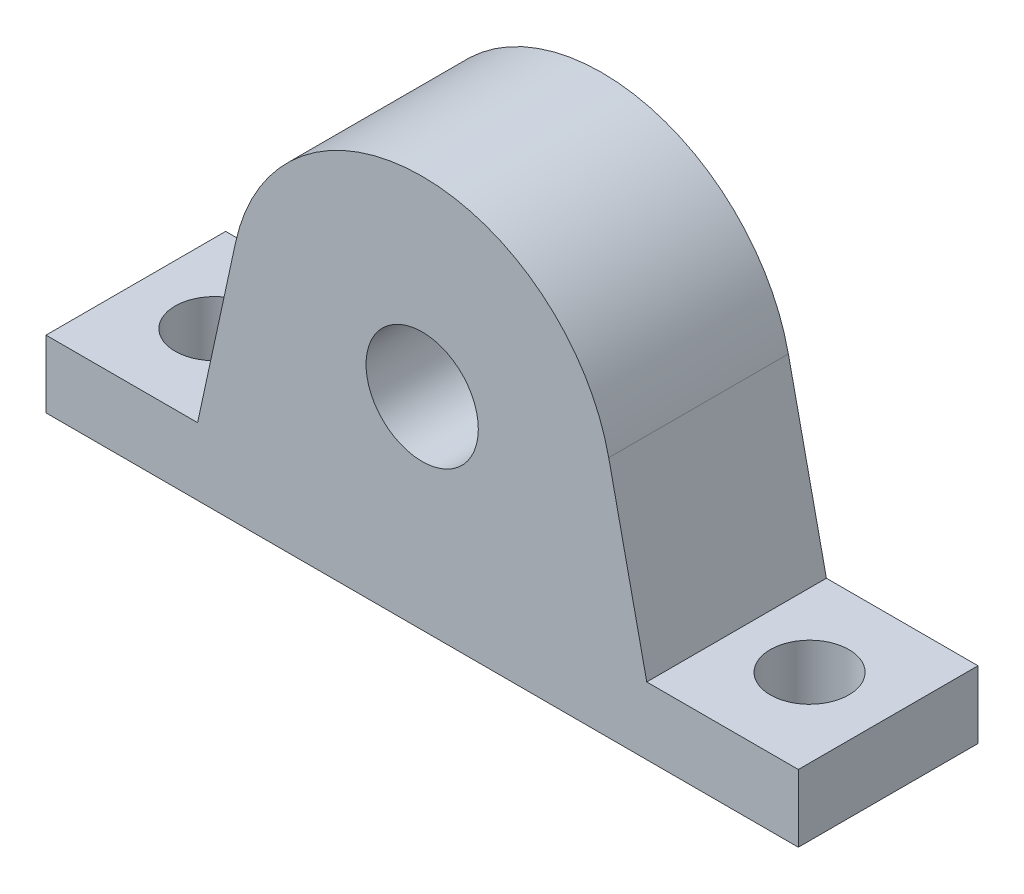
ISO-10303-21;
HEADER;
FILE_DESCRIPTION(('STEP AP214'),'2;1');
FILE_NAME('part.step','',(''),(''),'','','');
FILE_SCHEMA(('AUTOMOTIVE_DESIGN { 1 0 10303 214 1 1 1 1 }'));
ENDSEC;
DATA;
#1=APPLICATION_CONTEXT('core data for automotive mechanical design processes');
#2=APPLICATION_PROTOCOL_DEFINITION('international standard','automotive_design',2000,#1);
#3=PRODUCT_CONTEXT('',#1,'mechanical');
#4=PRODUCT('Part','Part','',(#3));
#5=PRODUCT_RELATED_PRODUCT_CATEGORY('part','',(#4));
#6=PRODUCT_DEFINITION_FORMATION('','',#4);
#7=PRODUCT_DEFINITION_CONTEXT('part definition',#1,'design');
#8=PRODUCT_DEFINITION('design','',#6,#7);
#9=PRODUCT_DEFINITION_SHAPE('','',#8);
#10=(LENGTH_UNIT() NAMED_UNIT(*) SI_UNIT(.MILLI.,.METRE.));
#11=(NAMED_UNIT(*) PLANE_ANGLE_UNIT() SI_UNIT($,.RADIAN.));
#12=(NAMED_UNIT(*) SI_UNIT($,.STERADIAN.) SOLID_ANGLE_UNIT());
#13=UNCERTAINTY_MEASURE_WITH_UNIT(LENGTH_MEASURE(1.E-05),#10,'distance_accuracy_value','');
#14=(GEOMETRIC_REPRESENTATION_CONTEXT(3) GLOBAL_UNCERTAINTY_ASSIGNED_CONTEXT((#13)) GLOBAL_UNIT_ASSIGNED_CONTEXT((#10,
#11,#12)) REPRESENTATION_CONTEXT('',''));
#15=CARTESIAN_POINT('',(0.,0.,0.));
#16=DIRECTION('',(0.,0.,1.));
#17=DIRECTION('',(1.,0.,0.));
#18=AXIS2_PLACEMENT_3D('',#15,#16,#17);
#19=CARTESIAN_POINT('',(-33.5,0.,8.));
#20=DIRECTION('',(1.,0.,0.));
#21=DIRECTION('',(0.,0.,-1.));
#22=AXIS2_PLACEMENT_3D('',#19,#20,#21);
#23=PLANE('',#22);
#24=DIRECTION('',(0.,-1.,0.));
#25=VECTOR('',#24,1.);
#26=CARTESIAN_POINT('',(-33.5,0.,-8.));
#27=LINE('',#26,#25);
#28=CARTESIAN_POINT('',(-33.5,6.,-8.));
#29=VERTEX_POINT('',#28);
#30=CARTESIAN_POINT('',(-33.5,0.,-8.));
#31=VERTEX_POINT('',#30);
#32=EDGE_CURVE('E140',#29,#31,#27,.T.);
#33=ORIENTED_EDGE('',*,*,#32,.T.);
#34=DIRECTION('',(0.,0.,-1.));
#35=VECTOR('',#34,1.);
#36=CARTESIAN_POINT('',(-33.5,0.,8.));
#37=LINE('',#36,#35);
#38=CARTESIAN_POINT('',(-33.5,0.,8.));
#39=VERTEX_POINT('',#38);
#40=EDGE_CURVE('E11',#39,#31,#37,.T.);
#41=ORIENTED_EDGE('',*,*,#40,.F.);
#42=DIRECTION('',(0.,-1.,0.));
#43=VECTOR('',#42,1.);
#44=CARTESIAN_POINT('',(-33.5,0.,8.));
#45=LINE('',#44,#43);
#46=CARTESIAN_POINT('',(-33.5,6.,8.));
#47=VERTEX_POINT('',#46);
#48=EDGE_CURVE('E163',#47,#39,#45,.T.);
#49=ORIENTED_EDGE('',*,*,#48,.F.);
#50=DIRECTION('',(0.,0.,-1.));
#51=VECTOR('',#50,1.);
#52=CARTESIAN_POINT('',(-33.5,6.,8.));
#53=LINE('',#52,#51);
#54=EDGE_CURVE('E136',#47,#29,#53,.T.);
#55=ORIENTED_EDGE('',*,*,#54,.T.);
#56=EDGE_LOOP('',(#33,#41,#49,#55));
#57=FACE_BOUND('',#56,.T.);
#58=ADVANCED_FACE('F39',(#57),#23,.F.);
#59=CARTESIAN_POINT('',(-33.5,0.,8.));
#60=DIRECTION('',(0.,1.,0.));
#61=DIRECTION('',(0.,0.,1.));
#62=AXIS2_PLACEMENT_3D('',#59,#60,#61);
#63=PLANE('',#62);
#64=CARTESIAN_POINT('',(-26.5,0.,0.));
#65=DIRECTION('',(0.,1.,0.));
#66=DIRECTION('',(0.,0.,1.));
#67=AXIS2_PLACEMENT_3D('',#64,#65,#66);
#68=CIRCLE('',#67,3.5);
#69=CARTESIAN_POINT('',(-26.5,0.,3.5));
#70=VERTEX_POINT('',#69);
#71=EDGE_CURVE('E210',#70,#70,#68,.T.);
#72=ORIENTED_EDGE('',*,*,#71,.T.);
#73=EDGE_LOOP('',(#72));
#74=FACE_BOUND('',#73,.T.);
#75=CARTESIAN_POINT('',(26.5,0.,0.));
#76=DIRECTION('',(0.,1.,0.));
#77=DIRECTION('',(0.,0.,1.));
#78=AXIS2_PLACEMENT_3D('',#75,#76,#77);
#79=CIRCLE('',#78,3.5);
#80=CARTESIAN_POINT('',(26.5,0.,3.5));
#81=VERTEX_POINT('',#80);
#82=EDGE_CURVE('E145',#81,#81,#79,.T.);
#83=ORIENTED_EDGE('',*,*,#82,.T.);
#84=EDGE_LOOP('',(#83));
#85=FACE_BOUND('',#84,.T.);
#86=DIRECTION('',(1.,0.,0.));
#87=VECTOR('',#86,1.);
#88=CARTESIAN_POINT('',(-33.5,0.,-8.));
#89=LINE('',#88,#87);
#90=CARTESIAN_POINT('',(33.5,0.,-8.));
#91=VERTEX_POINT('',#90);
#92=EDGE_CURVE('E144',#31,#91,#89,.T.);
#93=ORIENTED_EDGE('',*,*,#92,.T.);
#94=DIRECTION('',(0.,0.,-1.));
#95=VECTOR('',#94,1.);
#96=CARTESIAN_POINT('',(33.5,0.,8.));
#97=LINE('',#96,#95);
#98=CARTESIAN_POINT('',(33.5,0.,8.));
#99=VERTEX_POINT('',#98);
#100=EDGE_CURVE('E48',#99,#91,#97,.T.);
#101=ORIENTED_EDGE('',*,*,#100,.F.);
#102=DIRECTION('',(1.,0.,0.));
#103=VECTOR('',#102,1.);
#104=CARTESIAN_POINT('',(-33.5,0.,8.));
#105=LINE('',#104,#103);
#106=EDGE_CURVE('E99',#39,#99,#105,.T.);
#107=ORIENTED_EDGE('',*,*,#106,.F.);
#108=ORIENTED_EDGE('',*,*,#40,.T.);
#109=EDGE_LOOP('',(#93,#101,#107,#108));
#110=FACE_BOUND('',#109,.T.);
#111=ADVANCED_FACE('F252',(#74,#85,#110),#63,.F.);
#112=CARTESIAN_POINT('',(33.5,0.,8.));
#113=DIRECTION('',(-1.,0.,0.));
#114=DIRECTION('',(0.,0.,1.));
#115=AXIS2_PLACEMENT_3D('',#112,#113,#114);
#116=PLANE('',#115);
#117=DIRECTION('',(0.,1.,0.));
#118=VECTOR('',#117,1.);
#119=CARTESIAN_POINT('',(33.5,0.,-8.));
#120=LINE('',#119,#118);
#121=CARTESIAN_POINT('',(33.5,6.,-8.));
#122=VERTEX_POINT('',#121);
#123=EDGE_CURVE('E148',#91,#122,#120,.T.);
#124=ORIENTED_EDGE('',*,*,#123,.T.);
#125=DIRECTION('',(0.,0.,-1.));
#126=VECTOR('',#125,1.);
#127=CARTESIAN_POINT('',(33.5,6.,8.));
#128=LINE('',#127,#126);
#129=CARTESIAN_POINT('',(33.5,6.,8.));
#130=VERTEX_POINT('',#129);
#131=EDGE_CURVE('E174',#130,#122,#128,.T.);
#132=ORIENTED_EDGE('',*,*,#131,.F.);
#133=DIRECTION('',(0.,1.,0.));
#134=VECTOR('',#133,1.);
#135=CARTESIAN_POINT('',(33.5,0.,8.));
#136=LINE('',#135,#134);
#137=EDGE_CURVE('E184',#99,#130,#136,.T.);
#138=ORIENTED_EDGE('',*,*,#137,.F.);
#139=ORIENTED_EDGE('',*,*,#100,.T.);
#140=EDGE_LOOP('',(#124,#132,#138,#139));
#141=FACE_BOUND('',#140,.T.);
#142=ADVANCED_FACE('F182',(#141),#116,.F.);
#143=CARTESIAN_POINT('',(33.5,6.,8.));
#144=DIRECTION('',(0.,-1.,0.));
#145=DIRECTION('',(0.,0.,-1.));
#146=AXIS2_PLACEMENT_3D('',#143,#144,#145);
#147=PLANE('',#146);
#148=CARTESIAN_POINT('',(26.5,6.,0.));
#149=DIRECTION('',(0.,1.,0.));
#150=DIRECTION('',(0.,0.,1.));
#151=AXIS2_PLACEMENT_3D('',#148,#149,#150);
#152=CIRCLE('',#151,3.5);
#153=CARTESIAN_POINT('',(26.5,6.,3.5));
#154=VERTEX_POINT('',#153);
#155=EDGE_CURVE('E215',#154,#154,#152,.T.);
#156=ORIENTED_EDGE('',*,*,#155,.F.);
#157=EDGE_LOOP('',(#156));
#158=FACE_BOUND('',#157,.T.);
#159=DIRECTION('',(-1.,0.,0.));
#160=VECTOR('',#159,1.);
#161=CARTESIAN_POINT('',(33.5,6.,-8.));
#162=LINE('',#161,#160);
#163=CARTESIAN_POINT('',(20.,6.,-8.));
#164=VERTEX_POINT('',#163);
#165=EDGE_CURVE('E151',#122,#164,#162,.T.);
#166=ORIENTED_EDGE('',*,*,#165,.T.);
#167=DIRECTION('',(0.,0.,-1.));
#168=VECTOR('',#167,1.);
#169=CARTESIAN_POINT('',(20.,6.,8.));
#170=LINE('',#169,#168);
#171=CARTESIAN_POINT('',(20.,6.,8.));
#172=VERTEX_POINT('',#171);
#173=EDGE_CURVE('E170',#172,#164,#170,.T.);
#174=ORIENTED_EDGE('',*,*,#173,.F.);
#175=DIRECTION('',(-1.,0.,0.));
#176=VECTOR('',#175,1.);
#177=CARTESIAN_POINT('',(33.5,6.,8.));
#178=LINE('',#177,#176);
#179=EDGE_CURVE('E197',#130,#172,#178,.T.);
#180=ORIENTED_EDGE('',*,*,#179,.F.);
#181=ORIENTED_EDGE('',*,*,#131,.T.);
#182=EDGE_LOOP('',(#166,#174,#180,#181));
#183=FACE_BOUND('',#182,.T.);
#184=ADVANCED_FACE('F192',(#158,#183),#147,.F.);
#185=CARTESIAN_POINT('',(20.,6.,8.));
#186=DIRECTION('',(-0.977251163735397,-0.212085272892327,0.));
#187=DIRECTION('',(0.212085272892327,-0.977251163735397,0.));
#188=AXIS2_PLACEMENT_3D('',#185,#186,#187);
#189=PLANE('',#188);
#190=DIRECTION('',(-0.212085272892327,0.977251163735397,0.));
#191=VECTOR('',#190,1.);
#192=CARTESIAN_POINT('',(20.,6.,-8.));
#193=LINE('',#192,#191);
#194=CARTESIAN_POINT('',(16.6132697835017,21.6054496391696,-8.));
#195=VERTEX_POINT('',#194);
#196=EDGE_CURVE('E154',#164,#195,#193,.T.);
#197=ORIENTED_EDGE('',*,*,#196,.T.);
#198=DIRECTION('',(0.,0.,-1.));
#199=VECTOR('',#198,1.);
#200=CARTESIAN_POINT('',(16.6132697835017,21.6054496391696,8.));
#201=LINE('',#200,#199);
#202=CARTESIAN_POINT('',(16.6132697835017,21.6054496391696,8.));
#203=VERTEX_POINT('',#202);
#204=EDGE_CURVE('E129',#203,#195,#201,.T.);
#205=ORIENTED_EDGE('',*,*,#204,.F.);
#206=DIRECTION('',(-0.212085272892327,0.977251163735397,0.));
#207=VECTOR('',#206,1.);
#208=CARTESIAN_POINT('',(20.,6.,8.));
#209=LINE('',#208,#207);
#210=EDGE_CURVE('E118',#172,#203,#209,.T.);
#211=ORIENTED_EDGE('',*,*,#210,.F.);
#212=ORIENTED_EDGE('',*,*,#173,.T.);
#213=EDGE_LOOP('',(#197,#205,#211,#212));
#214=FACE_BOUND('',#213,.T.);
#215=ADVANCED_FACE('F195',(#214),#189,.F.);
#216=CARTESIAN_POINT('',(0.,18.,8.));
#217=DIRECTION('',(0.,0.,-1.));
#218=DIRECTION('',(-1.,0.,0.));
#219=AXIS2_PLACEMENT_3D('',#216,#217,#218);
#220=CYLINDRICAL_SURFACE('',#219,17.);
#221=CARTESIAN_POINT('',(0.,18.,-8.));
#222=DIRECTION('',(0.,0.,1.));
#223=DIRECTION('',(-1.,0.,0.));
#224=AXIS2_PLACEMENT_3D('',#221,#222,#223);
#225=CIRCLE('',#224,17.);
#226=CARTESIAN_POINT('',(-16.6132697835017,21.6054496391696,-8.));
#227=VERTEX_POINT('',#226);
#228=EDGE_CURVE('E127',#195,#227,#225,.T.);
#229=ORIENTED_EDGE('',*,*,#228,.T.);
#230=DIRECTION('',(0.,0.,-1.));
#231=VECTOR('',#230,1.);
#232=CARTESIAN_POINT('',(-16.6132697835017,21.6054496391696,8.));
#233=LINE('',#232,#231);
#234=CARTESIAN_POINT('',(-16.6132697835017,21.6054496391696,8.));
#235=VERTEX_POINT('',#234);
#236=EDGE_CURVE('E124',#235,#227,#233,.T.);
#237=ORIENTED_EDGE('',*,*,#236,.F.);
#238=CARTESIAN_POINT('',(0.,18.,8.));
#239=DIRECTION('',(0.,0.,1.));
#240=DIRECTION('',(-1.,0.,0.));
#241=AXIS2_PLACEMENT_3D('',#238,#239,#240);
#242=CIRCLE('',#241,17.);
#243=EDGE_CURVE('E112',#203,#235,#242,.T.);
#244=ORIENTED_EDGE('',*,*,#243,.F.);
#245=ORIENTED_EDGE('',*,*,#204,.T.);
#246=EDGE_LOOP('',(#229,#237,#244,#245));
#247=FACE_BOUND('',#246,.T.);
#248=ADVANCED_FACE('F125',(#247),#220,.T.);
#249=CARTESIAN_POINT('',(-20.,6.,8.));
#250=DIRECTION('',(0.977251163735397,-0.212085272892327,0.));
#251=DIRECTION('',(0.212085272892327,0.977251163735397,0.));
#252=AXIS2_PLACEMENT_3D('',#249,#250,#251);
#253=PLANE('',#252);
#254=DIRECTION('',(-0.212085272892327,-0.977251163735397,0.));
#255=VECTOR('',#254,1.);
#256=CARTESIAN_POINT('',(-20.,6.,-8.));
#257=LINE('',#256,#255);
#258=CARTESIAN_POINT('',(-20.,6.,-8.));
#259=VERTEX_POINT('',#258);
#260=EDGE_CURVE('E85',#227,#259,#257,.T.);
#261=ORIENTED_EDGE('',*,*,#260,.T.);
#262=DIRECTION('',(0.,0.,-1.));
#263=VECTOR('',#262,1.);
#264=CARTESIAN_POINT('',(-20.,6.,8.));
#265=LINE('',#264,#263);
#266=CARTESIAN_POINT('',(-20.,6.,8.));
#267=VERTEX_POINT('',#266);
#268=EDGE_CURVE('E130',#267,#259,#265,.T.);
#269=ORIENTED_EDGE('',*,*,#268,.F.);
#270=DIRECTION('',(-0.212085272892327,-0.977251163735397,0.));
#271=VECTOR('',#270,1.);
#272=CARTESIAN_POINT('',(-20.,6.,8.));
#273=LINE('',#272,#271);
#274=EDGE_CURVE('E116',#235,#267,#273,.T.);
#275=ORIENTED_EDGE('',*,*,#274,.F.);
#276=ORIENTED_EDGE('',*,*,#236,.T.);
#277=EDGE_LOOP('',(#261,#269,#275,#276));
#278=FACE_BOUND('',#277,.T.);
#279=ADVANCED_FACE('F132',(#278),#253,.F.);
#280=CARTESIAN_POINT('',(-33.5,6.,8.));
#281=DIRECTION('',(0.,-1.,0.));
#282=DIRECTION('',(0.,0.,-1.));
#283=AXIS2_PLACEMENT_3D('',#280,#281,#282);
#284=PLANE('',#283);
#285=CARTESIAN_POINT('',(-26.5,6.,0.));
#286=DIRECTION('',(0.,1.,0.));
#287=DIRECTION('',(0.,0.,1.));
#288=AXIS2_PLACEMENT_3D('',#285,#286,#287);
#289=CIRCLE('',#288,3.5);
#290=CARTESIAN_POINT('',(-26.5,6.,3.5));
#291=VERTEX_POINT('',#290);
#292=EDGE_CURVE('E214',#291,#291,#289,.T.);
#293=ORIENTED_EDGE('',*,*,#292,.F.);
#294=EDGE_LOOP('',(#293));
#295=FACE_BOUND('',#294,.T.);
#296=DIRECTION('',(-1.,0.,0.));
#297=VECTOR('',#296,1.);
#298=CARTESIAN_POINT('',(-33.5,6.,-8.));
#299=LINE('',#298,#297);
#300=EDGE_CURVE('E91',#259,#29,#299,.T.);
#301=ORIENTED_EDGE('',*,*,#300,.T.);
#302=ORIENTED_EDGE('',*,*,#54,.F.);
#303=DIRECTION('',(-1.,0.,0.));
#304=VECTOR('',#303,1.);
#305=CARTESIAN_POINT('',(-33.5,6.,8.));
#306=LINE('',#305,#304);
#307=EDGE_CURVE('E56',#267,#47,#306,.T.);
#308=ORIENTED_EDGE('',*,*,#307,.F.);
#309=ORIENTED_EDGE('',*,*,#268,.T.);
#310=EDGE_LOOP('',(#301,#302,#308,#309));
#311=FACE_BOUND('',#310,.T.);
#312=ADVANCED_FACE('F240',(#295,#311),#284,.F.);
#313=CARTESIAN_POINT('',(0.,18.,8.));
#314=DIRECTION('',(0.,0.,-1.));
#315=DIRECTION('',(-1.,0.,0.));
#316=AXIS2_PLACEMENT_3D('',#313,#314,#315);
#317=PLANE('',#316);
#318=CARTESIAN_POINT('',(0.,18.,8.));
#319=DIRECTION('',(0.,0.,1.));
#320=DIRECTION('',(1.,0.,0.));
#321=AXIS2_PLACEMENT_3D('',#318,#319,#320);
#322=CIRCLE('',#321,5.);
#323=CARTESIAN_POINT('',(5.,18.,8.));
#324=VERTEX_POINT('',#323);
#325=EDGE_CURVE('E223',#324,#324,#322,.T.);
#326=ORIENTED_EDGE('',*,*,#325,.F.);
#327=EDGE_LOOP('',(#326));
#328=FACE_BOUND('',#327,.T.);
#329=ORIENTED_EDGE('',*,*,#48,.T.);
#330=ORIENTED_EDGE('',*,*,#106,.T.);
#331=ORIENTED_EDGE('',*,*,#137,.T.);
#332=ORIENTED_EDGE('',*,*,#179,.T.);
#333=ORIENTED_EDGE('',*,*,#210,.T.);
#334=ORIENTED_EDGE('',*,*,#243,.T.);
#335=ORIENTED_EDGE('',*,*,#274,.T.);
#336=ORIENTED_EDGE('',*,*,#307,.T.);
#337=EDGE_LOOP('',(#329,#330,#331,#332,#333,#334,#335,#336));
#338=FACE_BOUND('',#337,.T.);
#339=ADVANCED_FACE('F114',(#328,#338),#317,.F.);
#340=CARTESIAN_POINT('',(0.,18.,-8.));
#341=DIRECTION('',(0.,0.,-1.));
#342=DIRECTION('',(-1.,0.,0.));
#343=AXIS2_PLACEMENT_3D('',#340,#341,#342);
#344=PLANE('',#343);
#345=CARTESIAN_POINT('',(0.,18.,-8.));
#346=DIRECTION('',(0.,0.,1.));
#347=DIRECTION('',(1.,0.,0.));
#348=AXIS2_PLACEMENT_3D('',#345,#346,#347);
#349=CIRCLE('',#348,5.);
#350=CARTESIAN_POINT('',(5.,18.,-8.));
#351=VERTEX_POINT('',#350);
#352=EDGE_CURVE('E219',#351,#351,#349,.T.);
#353=ORIENTED_EDGE('',*,*,#352,.T.);
#354=EDGE_LOOP('',(#353));
#355=FACE_BOUND('',#354,.T.);
#356=ORIENTED_EDGE('',*,*,#32,.F.);
#357=ORIENTED_EDGE('',*,*,#300,.F.);
#358=ORIENTED_EDGE('',*,*,#260,.F.);
#359=ORIENTED_EDGE('',*,*,#228,.F.);
#360=ORIENTED_EDGE('',*,*,#196,.F.);
#361=ORIENTED_EDGE('',*,*,#165,.F.);
#362=ORIENTED_EDGE('',*,*,#123,.F.);
#363=ORIENTED_EDGE('',*,*,#92,.F.);
#364=EDGE_LOOP('',(#356,#357,#358,#359,#360,#361,#362,#363));
#365=FACE_BOUND('',#364,.T.);
#366=ADVANCED_FACE('F188',(#355,#365),#344,.T.);
#367=CARTESIAN_POINT('',(-26.5,-10.,0.));
#368=DIRECTION('',(0.,1.,0.));
#369=DIRECTION('',(0.,0.,1.));
#370=AXIS2_PLACEMENT_3D('',#367,#368,#369);
#371=CYLINDRICAL_SURFACE('',#370,3.5);
#372=ORIENTED_EDGE('',*,*,#292,.T.);
#373=EDGE_LOOP('',(#372));
#374=FACE_BOUND('',#373,.T.);
#375=ORIENTED_EDGE('',*,*,#71,.F.);
#376=EDGE_LOOP('',(#375));
#377=FACE_BOUND('',#376,.T.);
#378=ADVANCED_FACE('F246',(#374,#377),#371,.F.);
#379=CARTESIAN_POINT('',(26.5,-10.,0.));
#380=DIRECTION('',(0.,1.,0.));
#381=DIRECTION('',(0.,0.,1.));
#382=AXIS2_PLACEMENT_3D('',#379,#380,#381);
#383=CYLINDRICAL_SURFACE('',#382,3.5);
#384=ORIENTED_EDGE('',*,*,#155,.T.);
#385=EDGE_LOOP('',(#384));
#386=FACE_BOUND('',#385,.T.);
#387=ORIENTED_EDGE('',*,*,#82,.F.);
#388=EDGE_LOOP('',(#387));
#389=FACE_BOUND('',#388,.T.);
#390=ADVANCED_FACE('F235',(#386,#389),#383,.F.);
#391=CARTESIAN_POINT('',(0.,18.,-8.));
#392=DIRECTION('',(0.,0.,1.));
#393=DIRECTION('',(1.,0.,0.));
#394=AXIS2_PLACEMENT_3D('',#391,#392,#393);
#395=CYLINDRICAL_SURFACE('',#394,5.);
#396=ORIENTED_EDGE('',*,*,#352,.F.);
#397=EDGE_LOOP('',(#396));
#398=FACE_BOUND('',#397,.T.);
#399=ORIENTED_EDGE('',*,*,#325,.T.);
#400=EDGE_LOOP('',(#399));
#401=FACE_BOUND('',#400,.T.);
#402=ADVANCED_FACE('F232',(#398,#401),#395,.F.);
#403=CLOSED_SHELL('',(#58,#111,#142,#184,#215,#248,#279,#312,#339,#366,#378,#390,#402));
#404=MANIFOLD_SOLID_BREP('B2',#403);
#405=ADVANCED_BREP_SHAPE_REPRESENTATION('',(#18,#404),#14);
#406=SHAPE_DEFINITION_REPRESENTATION(#9,#405);
ENDSEC;
END-ISO-10303-21;
